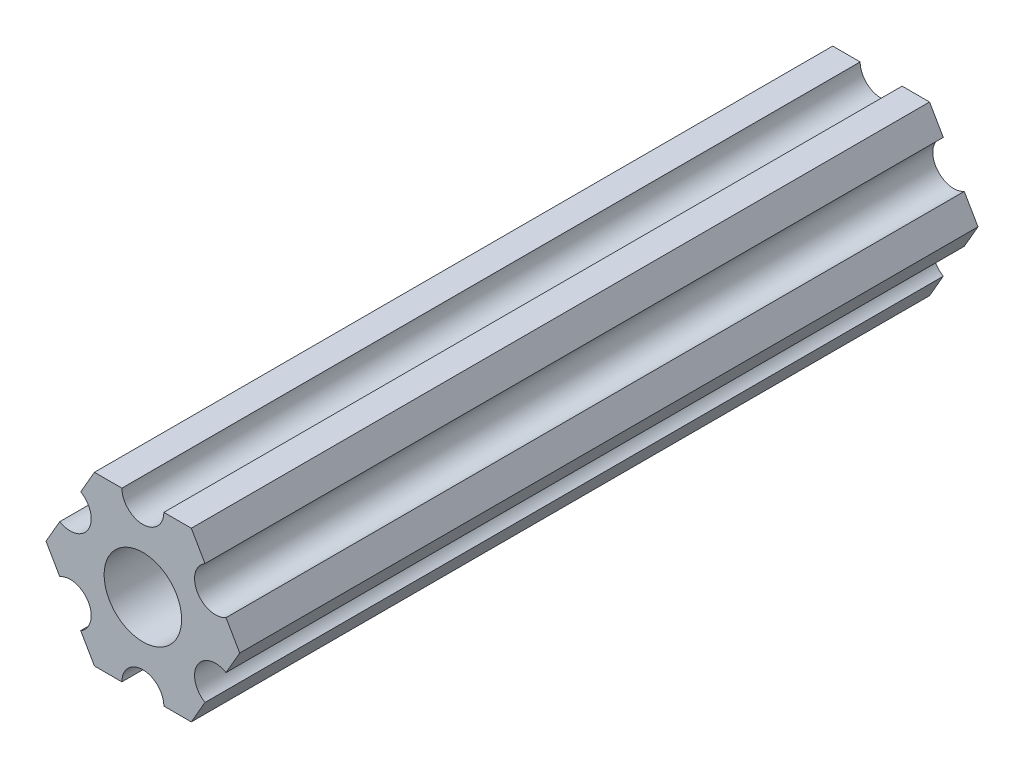
ISO-10303-21;
HEADER;
FILE_DESCRIPTION(('STEP AP214'),'2;1');
FILE_NAME('part.step','',(''),(''),'','','');
FILE_SCHEMA(('AUTOMOTIVE_DESIGN { 1 0 10303 214 1 1 1 1 }'));
ENDSEC;
DATA;
#1=APPLICATION_CONTEXT('core data for automotive mechanical design processes');
#2=APPLICATION_PROTOCOL_DEFINITION('international standard','automotive_design',2000,#1);
#3=PRODUCT_CONTEXT('',#1,'mechanical');
#4=PRODUCT('Part','Part','',(#3));
#5=PRODUCT_RELATED_PRODUCT_CATEGORY('part','',(#4));
#6=PRODUCT_DEFINITION_FORMATION('','',#4);
#7=PRODUCT_DEFINITION_CONTEXT('part definition',#1,'design');
#8=PRODUCT_DEFINITION('design','',#6,#7);
#9=PRODUCT_DEFINITION_SHAPE('','',#8);
#10=(LENGTH_UNIT() NAMED_UNIT(*) SI_UNIT(.MILLI.,.METRE.));
#11=(NAMED_UNIT(*) PLANE_ANGLE_UNIT() SI_UNIT($,.RADIAN.));
#12=(NAMED_UNIT(*) SI_UNIT($,.STERADIAN.) SOLID_ANGLE_UNIT());
#13=UNCERTAINTY_MEASURE_WITH_UNIT(LENGTH_MEASURE(1.E-05),#10,'distance_accuracy_value','');
#14=(GEOMETRIC_REPRESENTATION_CONTEXT(3) GLOBAL_UNCERTAINTY_ASSIGNED_CONTEXT((#13)) GLOBAL_UNIT_ASSIGNED_CONTEXT((#10,
#11,#12)) REPRESENTATION_CONTEXT('',''));
#15=CARTESIAN_POINT('',(0.,0.,0.));
#16=DIRECTION('',(0.,0.,1.));
#17=DIRECTION('',(1.,0.,0.));
#18=AXIS2_PLACEMENT_3D('',#15,#16,#17);
#19=CARTESIAN_POINT('',(-5.49926150638083,-3.17499966684068,-55.88));
#20=DIRECTION('',(0.,0.,1.));
#21=DIRECTION('',(1.,0.,0.));
#22=AXIS2_PLACEMENT_3D('',#19,#20,#21);
#23=CYLINDRICAL_SURFACE('',#22,1.58750000000001);
#24=CARTESIAN_POINT('',(-5.49926150638083,-3.17499966684068,0.));
#25=DIRECTION('',(0.,0.,-1.));
#26=DIRECTION('',(-1.,0.,0.));
#27=AXIS2_PLACEMENT_3D('',#24,#25,#26);
#28=CIRCLE('',#27,1.58750000000001);
#29=CARTESIAN_POINT('',(-6.29301142309098,-1.80018429024546,0.));
#30=VERTEX_POINT('',#29);
#31=CARTESIAN_POINT('',(-4.70551158967068,-4.54981504343589,0.));
#32=VERTEX_POINT('',#31);
#33=EDGE_CURVE('E196',#30,#32,#28,.T.);
#34=ORIENTED_EDGE('',*,*,#33,.F.);
#35=DIRECTION('',(0.,0.,1.));
#36=VECTOR('',#35,1.);
#37=CARTESIAN_POINT('',(-6.29301142309098,-1.80018429024546,-55.88));
#38=LINE('',#37,#36);
#39=CARTESIAN_POINT('',(-6.29301142309098,-1.80018429024546,-55.88));
#40=VERTEX_POINT('',#39);
#41=EDGE_CURVE('E11',#40,#30,#38,.T.);
#42=ORIENTED_EDGE('',*,*,#41,.F.);
#43=CARTESIAN_POINT('',(-5.49926150638083,-3.17499966684068,-55.88));
#44=DIRECTION('',(0.,0.,-1.));
#45=DIRECTION('',(-1.,0.,0.));
#46=AXIS2_PLACEMENT_3D('',#43,#44,#45);
#47=CIRCLE('',#46,1.58750000000001);
#48=CARTESIAN_POINT('',(-4.70551158967068,-4.54981504343589,-55.88));
#49=VERTEX_POINT('',#48);
#50=EDGE_CURVE('E247',#40,#49,#47,.T.);
#51=ORIENTED_EDGE('',*,*,#50,.T.);
#52=DIRECTION('',(0.,0.,1.));
#53=VECTOR('',#52,1.);
#54=CARTESIAN_POINT('',(-4.70551158967068,-4.54981504343589,-55.88));
#55=LINE('',#54,#53);
#56=EDGE_CURVE('E42',#49,#32,#55,.T.);
#57=ORIENTED_EDGE('',*,*,#56,.T.);
#58=EDGE_LOOP('',(#34,#42,#51,#57));
#59=FACE_BOUND('',#58,.T.);
#60=ADVANCED_FACE('F39',(#59),#23,.F.);
#61=CARTESIAN_POINT('',(-7.33234841870826,4.44212518856872E-07,-55.88));
#62=DIRECTION('',(-0.866025434075723,-0.499999947533953,0.));
#63=DIRECTION('',(0.499999947533953,-0.866025434075723,0.));
#64=AXIS2_PLACEMENT_3D('',#61,#62,#63);
#65=PLANE('',#64);
#66=DIRECTION('',(0.499999947533953,-0.866025434075723,0.));
#67=VECTOR('',#66,1.);
#68=CARTESIAN_POINT('',(-7.33234841870826,4.44212518856872E-07,0.));
#69=LINE('',#68,#67);
#70=CARTESIAN_POINT('',(-7.33234841870826,4.44212518856872E-07,0.));
#71=VERTEX_POINT('',#70);
#72=EDGE_CURVE('E245',#71,#30,#69,.T.);
#73=ORIENTED_EDGE('',*,*,#72,.F.);
#74=DIRECTION('',(0.,0.,1.));
#75=VECTOR('',#74,1.);
#76=CARTESIAN_POINT('',(-7.33234841870826,4.44212518856872E-07,-55.88));
#77=LINE('',#76,#75);
#78=CARTESIAN_POINT('',(-7.33234841870826,4.44212518856872E-07,-55.88));
#79=VERTEX_POINT('',#78);
#80=EDGE_CURVE('E48',#79,#71,#77,.T.);
#81=ORIENTED_EDGE('',*,*,#80,.F.);
#82=DIRECTION('',(0.499999947533953,-0.866025434075723,0.));
#83=VECTOR('',#82,1.);
#84=CARTESIAN_POINT('',(-7.33234841870826,4.44212518856872E-07,-55.88));
#85=LINE('',#84,#83);
#86=EDGE_CURVE('E186',#79,#40,#85,.T.);
#87=ORIENTED_EDGE('',*,*,#86,.T.);
#88=ORIENTED_EDGE('',*,*,#41,.T.);
#89=EDGE_LOOP('',(#73,#81,#87,#88));
#90=FACE_BOUND('',#89,.T.);
#91=ADVANCED_FACE('F279',(#90),#65,.T.);
#92=CARTESIAN_POINT('',(-6.29301120497139,1.80018505273895,-55.88));
#93=DIRECTION('',(-0.866025373493145,0.500000052466056,0.));
#94=DIRECTION('',(-0.500000052466056,-0.866025373493145,0.));
#95=AXIS2_PLACEMENT_3D('',#92,#93,#94);
#96=PLANE('',#95);
#97=DIRECTION('',(-0.500000052466056,-0.866025373493145,0.));
#98=VECTOR('',#97,1.);
#99=CARTESIAN_POINT('',(-6.29301120497139,1.80018505273895,0.));
#100=LINE('',#99,#98);
#101=CARTESIAN_POINT('',(-6.29301120497139,1.80018505273895,0.));
#102=VERTEX_POINT('',#101);
#103=EDGE_CURVE('E173',#102,#71,#100,.T.);
#104=ORIENTED_EDGE('',*,*,#103,.F.);
#105=DIRECTION('',(0.,0.,1.));
#106=VECTOR('',#105,1.);
#107=CARTESIAN_POINT('',(-6.29301120497139,1.80018505273895,-55.88));
#108=LINE('',#107,#106);
#109=CARTESIAN_POINT('',(-6.29301120497139,1.80018505273895,-55.88));
#110=VERTEX_POINT('',#109);
#111=EDGE_CURVE('E168',#110,#102,#108,.T.);
#112=ORIENTED_EDGE('',*,*,#111,.F.);
#113=DIRECTION('',(-0.500000052466056,-0.866025373493145,0.));
#114=VECTOR('',#113,1.);
#115=CARTESIAN_POINT('',(-6.29301120497139,1.80018505273895,-55.88));
#116=LINE('',#115,#114);
#117=EDGE_CURVE('E171',#110,#79,#116,.T.);
#118=ORIENTED_EDGE('',*,*,#117,.T.);
#119=ORIENTED_EDGE('',*,*,#80,.T.);
#120=EDGE_LOOP('',(#104,#112,#118,#119));
#121=FACE_BOUND('',#120,.T.);
#122=ADVANCED_FACE('F170',(#121),#96,.T.);
#123=CARTESIAN_POINT('',(-5.49926112168152,3.17500033315931,-55.88));
#124=DIRECTION('',(0.,0.,1.));
#125=DIRECTION('',(1.,0.,0.));
#126=AXIS2_PLACEMENT_3D('',#123,#124,#125);
#127=CYLINDRICAL_SURFACE('',#126,1.5875);
#128=CARTESIAN_POINT('',(-5.49926112168152,3.17500033315931,0.));
#129=DIRECTION('',(0.,0.,-1.));
#130=DIRECTION('',(-1.,0.,0.));
#131=AXIS2_PLACEMENT_3D('',#128,#129,#130);
#132=CIRCLE('',#131,1.5875);
#133=CARTESIAN_POINT('',(-4.70551103839166,4.54981561357968,0.));
#134=VERTEX_POINT('',#133);
#135=EDGE_CURVE('E242',#134,#102,#132,.T.);
#136=ORIENTED_EDGE('',*,*,#135,.F.);
#137=DIRECTION('',(0.,0.,1.));
#138=VECTOR('',#137,1.);
#139=CARTESIAN_POINT('',(-4.70551103839166,4.54981561357968,-55.88));
#140=LINE('',#139,#138);
#141=CARTESIAN_POINT('',(-4.70551103839166,4.54981561357968,-55.88));
#142=VERTEX_POINT('',#141);
#143=EDGE_CURVE('E178',#142,#134,#140,.T.);
#144=ORIENTED_EDGE('',*,*,#143,.F.);
#145=CARTESIAN_POINT('',(-5.49926112168152,3.17500033315931,-55.88));
#146=DIRECTION('',(0.,0.,-1.));
#147=DIRECTION('',(-1.,0.,0.));
#148=AXIS2_PLACEMENT_3D('',#145,#146,#147);
#149=CIRCLE('',#148,1.5875);
#150=EDGE_CURVE('E184',#142,#110,#149,.T.);
#151=ORIENTED_EDGE('',*,*,#150,.T.);
#152=ORIENTED_EDGE('',*,*,#111,.T.);
#153=EDGE_LOOP('',(#136,#144,#151,#152));
#154=FACE_BOUND('',#153,.T.);
#155=ADVANCED_FACE('F188',(#154),#127,.F.);
#156=CARTESIAN_POINT('',(-3.66617382465472,6.35000022210622,-55.88));
#157=DIRECTION('',(-0.866025373493145,0.500000052466056,0.));
#158=DIRECTION('',(-0.500000052466056,-0.866025373493145,0.));
#159=AXIS2_PLACEMENT_3D('',#156,#157,#158);
#160=PLANE('',#159);
#161=DIRECTION('',(-0.500000052466056,-0.866025373493145,0.));
#162=VECTOR('',#161,1.);
#163=CARTESIAN_POINT('',(-3.66617382465472,6.35000022210622,0.));
#164=LINE('',#163,#162);
#165=CARTESIAN_POINT('',(-3.66617382465472,6.35000022210622,0.));
#166=VERTEX_POINT('',#165);
#167=EDGE_CURVE('E239',#166,#134,#164,.T.);
#168=ORIENTED_EDGE('',*,*,#167,.F.);
#169=DIRECTION('',(0.,0.,1.));
#170=VECTOR('',#169,1.);
#171=CARTESIAN_POINT('',(-3.66617382465472,6.35000022210622,-55.88));
#172=LINE('',#171,#170);
#173=CARTESIAN_POINT('',(-3.66617382465472,6.35000022210622,-55.88));
#174=VERTEX_POINT('',#173);
#175=EDGE_CURVE('E251',#174,#166,#172,.T.);
#176=ORIENTED_EDGE('',*,*,#175,.F.);
#177=DIRECTION('',(-0.500000052466056,-0.866025373493145,0.));
#178=VECTOR('',#177,1.);
#179=CARTESIAN_POINT('',(-3.66617382465472,6.35000022210622,-55.88));
#180=LINE('',#179,#178);
#181=EDGE_CURVE('E189',#174,#142,#180,.T.);
#182=ORIENTED_EDGE('',*,*,#181,.T.);
#183=ORIENTED_EDGE('',*,*,#143,.T.);
#184=EDGE_LOOP('',(#168,#176,#182,#183));
#185=FACE_BOUND('',#184,.T.);
#186=ADVANCED_FACE('F292',(#185),#160,.T.);
#187=CARTESIAN_POINT('',(-1.58749884590197,6.35000022210623,-55.88));
#188=DIRECTION('',(0.,1.,0.));
#189=DIRECTION('',(-1.,0.,0.));
#190=AXIS2_PLACEMENT_3D('',#187,#188,#189);
#191=PLANE('',#190);
#192=DIRECTION('',(-1.,0.,0.));
#193=VECTOR('',#192,1.);
#194=CARTESIAN_POINT('',(-1.58749884590197,6.35000022210623,0.));
#195=LINE('',#194,#193);
#196=CARTESIAN_POINT('',(-1.58749884590197,6.35000022210623,0.));
#197=VERTEX_POINT('',#196);
#198=EDGE_CURVE('E236',#197,#166,#195,.T.);
#199=ORIENTED_EDGE('',*,*,#198,.F.);
#200=DIRECTION('',(0.,0.,1.));
#201=VECTOR('',#200,1.);
#202=CARTESIAN_POINT('',(-1.58749884590197,6.35000022210623,-55.88));
#203=LINE('',#202,#201);
#204=CARTESIAN_POINT('',(-1.58749884590197,6.35000022210623,-55.88));
#205=VERTEX_POINT('',#204);
#206=EDGE_CURVE('E253',#205,#197,#203,.T.);
#207=ORIENTED_EDGE('',*,*,#206,.F.);
#208=DIRECTION('',(-1.,0.,0.));
#209=VECTOR('',#208,1.);
#210=CARTESIAN_POINT('',(-1.58749884590197,6.35000022210623,-55.88));
#211=LINE('',#210,#209);
#212=EDGE_CURVE('E191',#205,#174,#211,.T.);
#213=ORIENTED_EDGE('',*,*,#212,.T.);
#214=ORIENTED_EDGE('',*,*,#175,.T.);
#215=EDGE_LOOP('',(#199,#207,#213,#214));
#216=FACE_BOUND('',#215,.T.);
#217=ADVANCED_FACE('F295',(#216),#191,.T.);
#218=CARTESIAN_POINT('',(3.84699344941095E-07,6.35000022210623,-55.88));
#219=DIRECTION('',(0.,0.,1.));
#220=DIRECTION('',(1.,0.,0.));
#221=AXIS2_PLACEMENT_3D('',#218,#219,#220);
#222=CYLINDRICAL_SURFACE('',#221,1.58749884590197);
#223=CARTESIAN_POINT('',(3.84699344941095E-07,6.35000022210623,0.));
#224=DIRECTION('',(0.,0.,-1.));
#225=DIRECTION('',(-1.,0.,0.));
#226=AXIS2_PLACEMENT_3D('',#223,#224,#225);
#227=CIRCLE('',#226,1.58749884590197);
#228=CARTESIAN_POINT('',(1.58749923060131,6.35000022210623,0.));
#229=VERTEX_POINT('',#228);
#230=EDGE_CURVE('E233',#229,#197,#227,.T.);
#231=ORIENTED_EDGE('',*,*,#230,.F.);
#232=DIRECTION('',(0.,0.,1.));
#233=VECTOR('',#232,1.);
#234=CARTESIAN_POINT('',(1.58749923060131,6.35000022210623,-55.88));
#235=LINE('',#234,#233);
#236=CARTESIAN_POINT('',(1.58749923060131,6.35000022210623,-55.88));
#237=VERTEX_POINT('',#236);
#238=EDGE_CURVE('E255',#237,#229,#235,.T.);
#239=ORIENTED_EDGE('',*,*,#238,.F.);
#240=CARTESIAN_POINT('',(3.84699344941095E-07,6.35000022210623,-55.88));
#241=DIRECTION('',(0.,0.,-1.));
#242=DIRECTION('',(-1.,0.,0.));
#243=AXIS2_PLACEMENT_3D('',#240,#241,#242);
#244=CIRCLE('',#243,1.58749884590197);
#245=EDGE_CURVE('E400',#237,#205,#244,.T.);
#246=ORIENTED_EDGE('',*,*,#245,.T.);
#247=ORIENTED_EDGE('',*,*,#206,.T.);
#248=EDGE_LOOP('',(#231,#239,#246,#247));
#249=FACE_BOUND('',#248,.T.);
#250=ADVANCED_FACE('F299',(#249),#222,.F.);
#251=CARTESIAN_POINT('',(3.66617452134701,6.35000022210623,-55.88));
#252=DIRECTION('',(0.,1.,0.));
#253=DIRECTION('',(-1.,0.,0.));
#254=AXIS2_PLACEMENT_3D('',#251,#252,#253);
#255=PLANE('',#254);
#256=DIRECTION('',(-1.,0.,0.));
#257=VECTOR('',#256,1.);
#258=CARTESIAN_POINT('',(3.66617452134701,6.35000022210623,0.));
#259=LINE('',#258,#257);
#260=CARTESIAN_POINT('',(3.66617452134701,6.35000022210623,0.));
#261=VERTEX_POINT('',#260);
#262=EDGE_CURVE('E230',#261,#229,#259,.T.);
#263=ORIENTED_EDGE('',*,*,#262,.F.);
#264=DIRECTION('',(0.,0.,1.));
#265=VECTOR('',#264,1.);
#266=CARTESIAN_POINT('',(3.66617452134701,6.35000022210623,-55.88));
#267=LINE('',#266,#265);
#268=CARTESIAN_POINT('',(3.66617452134701,6.35000022210623,-55.88));
#269=VERTEX_POINT('',#268);
#270=EDGE_CURVE('E257',#269,#261,#267,.T.);
#271=ORIENTED_EDGE('',*,*,#270,.F.);
#272=DIRECTION('',(-1.,0.,0.));
#273=VECTOR('',#272,1.);
#274=CARTESIAN_POINT('',(3.66617452134701,6.35000022210623,-55.88));
#275=LINE('',#274,#273);
#276=EDGE_CURVE('E397',#269,#237,#275,.T.);
#277=ORIENTED_EDGE('',*,*,#276,.T.);
#278=ORIENTED_EDGE('',*,*,#238,.T.);
#279=EDGE_LOOP('',(#263,#271,#277,#278));
#280=FACE_BOUND('',#279,.T.);
#281=ADVANCED_FACE('F303',(#280),#255,.T.);
#282=CARTESIAN_POINT('',(4.70551142760333,4.54981551649452,-55.88));
#283=DIRECTION('',(0.866025449221368,0.499999921300922,0.));
#284=DIRECTION('',(-0.499999921300922,0.866025449221368,0.));
#285=AXIS2_PLACEMENT_3D('',#282,#283,#284);
#286=PLANE('',#285);
#287=DIRECTION('',(-0.499999921300922,0.866025449221368,0.));
#288=VECTOR('',#287,1.);
#289=CARTESIAN_POINT('',(4.70551142760333,4.54981551649452,0.));
#290=LINE('',#289,#288);
#291=CARTESIAN_POINT('',(4.70551142760333,4.54981551649452,0.));
#292=VERTEX_POINT('',#291);
#293=EDGE_CURVE('E227',#292,#261,#290,.T.);
#294=ORIENTED_EDGE('',*,*,#293,.F.);
#295=DIRECTION('',(0.,0.,1.));
#296=VECTOR('',#295,1.);
#297=CARTESIAN_POINT('',(4.70551142760333,4.54981551649452,-55.88));
#298=LINE('',#297,#296);
#299=CARTESIAN_POINT('',(4.70551142760333,4.54981551649452,-55.88));
#300=VERTEX_POINT('',#299);
#301=EDGE_CURVE('E259',#300,#292,#298,.T.);
#302=ORIENTED_EDGE('',*,*,#301,.F.);
#303=DIRECTION('',(-0.499999921300922,0.866025449221368,0.));
#304=VECTOR('',#303,1.);
#305=CARTESIAN_POINT('',(4.70551142760333,4.54981551649452,-55.88));
#306=LINE('',#305,#304);
#307=EDGE_CURVE('E394',#300,#269,#306,.T.);
#308=ORIENTED_EDGE('',*,*,#307,.T.);
#309=ORIENTED_EDGE('',*,*,#270,.T.);
#310=EDGE_LOOP('',(#294,#302,#308,#309));
#311=FACE_BOUND('',#310,.T.);
#312=ADVANCED_FACE('F307',(#311),#286,.T.);
#313=CARTESIAN_POINT('',(5.49926130266854,3.1750001158556,-55.88));
#314=DIRECTION('',(0.,0.,1.));
#315=DIRECTION('',(1.,0.,0.));
#316=AXIS2_PLACEMENT_3D('',#313,#314,#315);
#317=CYLINDRICAL_SURFACE('',#316,1.5875);
#318=CARTESIAN_POINT('',(5.49926130266854,3.1750001158556,0.));
#319=DIRECTION('',(0.,0.,-1.));
#320=DIRECTION('',(-1.,0.,0.));
#321=AXIS2_PLACEMENT_3D('',#318,#319,#320);
#322=CIRCLE('',#321,1.5875);
#323=CARTESIAN_POINT('',(6.29301117773375,1.80018471521667,0.));
#324=VERTEX_POINT('',#323);
#325=EDGE_CURVE('E224',#324,#292,#322,.T.);
#326=ORIENTED_EDGE('',*,*,#325,.F.);
#327=DIRECTION('',(0.,0.,1.));
#328=VECTOR('',#327,1.);
#329=CARTESIAN_POINT('',(6.29301117773375,1.80018471521667,-55.88));
#330=LINE('',#329,#328);
#331=CARTESIAN_POINT('',(6.29301117773375,1.80018471521667,-55.88));
#332=VERTEX_POINT('',#331);
#333=EDGE_CURVE('E261',#332,#324,#330,.T.);
#334=ORIENTED_EDGE('',*,*,#333,.F.);
#335=CARTESIAN_POINT('',(5.49926130266854,3.1750001158556,-55.88));
#336=DIRECTION('',(0.,0.,-1.));
#337=DIRECTION('',(-1.,0.,0.));
#338=AXIS2_PLACEMENT_3D('',#335,#336,#337);
#339=CIRCLE('',#338,1.5875);
#340=EDGE_CURVE('E391',#332,#300,#339,.T.);
#341=ORIENTED_EDGE('',*,*,#340,.T.);
#342=ORIENTED_EDGE('',*,*,#301,.T.);
#343=EDGE_LOOP('',(#326,#334,#341,#342));
#344=FACE_BOUND('',#343,.T.);
#345=ADVANCED_FACE('F311',(#344),#317,.F.);
#346=CARTESIAN_POINT('',(7.33234803400895,9.61748368946088E-08,-55.88));
#347=DIRECTION('',(0.866025449221368,0.499999921300922,0.));
#348=DIRECTION('',(-0.499999921300922,0.866025449221368,0.));
#349=AXIS2_PLACEMENT_3D('',#346,#347,#348);
#350=PLANE('',#349);
#351=DIRECTION('',(-0.499999921300922,0.866025449221368,0.));
#352=VECTOR('',#351,1.);
#353=CARTESIAN_POINT('',(7.33234803400895,9.61748368946088E-08,0.));
#354=LINE('',#353,#352);
#355=CARTESIAN_POINT('',(7.33234803400895,9.61748368946088E-08,0.));
#356=VERTEX_POINT('',#355);
#357=EDGE_CURVE('E221',#356,#324,#354,.T.);
#358=ORIENTED_EDGE('',*,*,#357,.F.);
#359=DIRECTION('',(0.,0.,1.));
#360=VECTOR('',#359,1.);
#361=CARTESIAN_POINT('',(7.33234803400895,9.61748368946088E-08,-55.88));
#362=LINE('',#361,#360);
#363=CARTESIAN_POINT('',(7.33234803400895,9.61748368946088E-08,-55.88));
#364=VERTEX_POINT('',#363);
#365=EDGE_CURVE('E263',#364,#356,#362,.T.);
#366=ORIENTED_EDGE('',*,*,#365,.F.);
#367=DIRECTION('',(-0.499999921300922,0.866025449221368,0.));
#368=VECTOR('',#367,1.);
#369=CARTESIAN_POINT('',(7.33234803400895,9.61748368946088E-08,-55.88));
#370=LINE('',#369,#368);
#371=EDGE_CURVE('E388',#364,#332,#370,.T.);
#372=ORIENTED_EDGE('',*,*,#371,.T.);
#373=ORIENTED_EDGE('',*,*,#333,.T.);
#374=EDGE_LOOP('',(#358,#366,#372,#373));
#375=FACE_BOUND('',#374,.T.);
#376=ADVANCED_FACE('F315',(#375),#350,.T.);
#377=CARTESIAN_POINT('',(6.29301092933191,-1.80018457531732,-55.88));
#378=DIRECTION('',(0.866025403784438,-0.5,0.));
#379=DIRECTION('',(0.5,0.866025403784438,0.));
#380=AXIS2_PLACEMENT_3D('',#377,#378,#379);
#381=PLANE('',#380);
#382=DIRECTION('',(0.5,0.866025403784438,0.));
#383=VECTOR('',#382,1.);
#384=CARTESIAN_POINT('',(6.29301092933191,-1.80018457531732,0.));
#385=LINE('',#384,#383);
#386=CARTESIAN_POINT('',(6.29301092933191,-1.80018457531732,0.));
#387=VERTEX_POINT('',#386);
#388=EDGE_CURVE('E218',#387,#356,#385,.T.);
#389=ORIENTED_EDGE('',*,*,#388,.F.);
#390=DIRECTION('',(0.,0.,1.));
#391=VECTOR('',#390,1.);
#392=CARTESIAN_POINT('',(6.29301092933191,-1.80018457531732,-55.88));
#393=LINE('',#392,#391);
#394=CARTESIAN_POINT('',(6.29301092933191,-1.80018457531732,-55.88));
#395=VERTEX_POINT('',#394);
#396=EDGE_CURVE('E265',#395,#387,#393,.T.);
#397=ORIENTED_EDGE('',*,*,#396,.F.);
#398=DIRECTION('',(0.5,0.866025403784438,0.));
#399=VECTOR('',#398,1.);
#400=CARTESIAN_POINT('',(6.29301092933191,-1.80018457531732,-55.88));
#401=LINE('',#400,#399);
#402=EDGE_CURVE('E385',#395,#364,#401,.T.);
#403=ORIENTED_EDGE('',*,*,#402,.T.);
#404=ORIENTED_EDGE('',*,*,#365,.T.);
#405=EDGE_LOOP('',(#389,#397,#403,#404));
#406=FACE_BOUND('',#405,.T.);
#407=ADVANCED_FACE('F319',(#406),#381,.T.);
#408=CARTESIAN_POINT('',(5.49926092933191,-3.17499990382512,-55.88));
#409=DIRECTION('',(0.,0.,1.));
#410=DIRECTION('',(1.,0.,0.));
#411=AXIS2_PLACEMENT_3D('',#408,#409,#410);
#412=CYLINDRICAL_SURFACE('',#411,1.5875);
#413=CARTESIAN_POINT('',(5.49926092933191,-3.17499990382512,0.));
#414=DIRECTION('',(0.,0.,-1.));
#415=DIRECTION('',(-1.,0.,0.));
#416=AXIS2_PLACEMENT_3D('',#413,#414,#415);
#417=CIRCLE('',#416,1.5875);
#418=CARTESIAN_POINT('',(4.70551092933191,-4.54981523233291,0.));
#419=VERTEX_POINT('',#418);
#420=EDGE_CURVE('E215',#419,#387,#417,.T.);
#421=ORIENTED_EDGE('',*,*,#420,.F.);
#422=DIRECTION('',(0.,0.,1.));
#423=VECTOR('',#422,1.);
#424=CARTESIAN_POINT('',(4.70551092933191,-4.54981523233291,-55.88));
#425=LINE('',#424,#423);
#426=CARTESIAN_POINT('',(4.70551092933191,-4.54981523233291,-55.88));
#427=VERTEX_POINT('',#426);
#428=EDGE_CURVE('E267',#427,#419,#425,.T.);
#429=ORIENTED_EDGE('',*,*,#428,.F.);
#430=CARTESIAN_POINT('',(5.49926092933191,-3.17499990382512,-55.88));
#431=DIRECTION('',(0.,0.,-1.));
#432=DIRECTION('',(-1.,0.,0.));
#433=AXIS2_PLACEMENT_3D('',#430,#431,#432);
#434=CIRCLE('',#433,1.5875);
#435=EDGE_CURVE('E382',#427,#395,#434,.T.);
#436=ORIENTED_EDGE('',*,*,#435,.T.);
#437=ORIENTED_EDGE('',*,*,#396,.T.);
#438=EDGE_LOOP('',(#421,#429,#436,#437));
#439=FACE_BOUND('',#438,.T.);
#440=ADVANCED_FACE('F323',(#439),#412,.F.);
#441=CARTESIAN_POINT('',(3.66617382465481,-6.34999990382519,-55.88));
#442=DIRECTION('',(0.866025403784438,-0.5,0.));
#443=DIRECTION('',(0.5,0.866025403784439,0.));
#444=AXIS2_PLACEMENT_3D('',#441,#442,#443);
#445=PLANE('',#444);
#446=DIRECTION('',(0.5,0.866025403784439,0.));
#447=VECTOR('',#446,1.);
#448=CARTESIAN_POINT('',(3.66617382465481,-6.34999990382519,0.));
#449=LINE('',#448,#447);
#450=CARTESIAN_POINT('',(3.66617382465481,-6.34999990382519,0.));
#451=VERTEX_POINT('',#450);
#452=EDGE_CURVE('E212',#451,#419,#449,.T.);
#453=ORIENTED_EDGE('',*,*,#452,.F.);
#454=DIRECTION('',(0.,0.,1.));
#455=VECTOR('',#454,1.);
#456=CARTESIAN_POINT('',(3.66617382465481,-6.34999990382519,-55.88));
#457=LINE('',#456,#455);
#458=CARTESIAN_POINT('',(3.66617382465481,-6.34999990382519,-55.88));
#459=VERTEX_POINT('',#458);
#460=EDGE_CURVE('E269',#459,#451,#457,.T.);
#461=ORIENTED_EDGE('',*,*,#460,.F.);
#462=DIRECTION('',(0.5,0.866025403784439,0.));
#463=VECTOR('',#462,1.);
#464=CARTESIAN_POINT('',(3.66617382465481,-6.34999990382519,-55.88));
#465=LINE('',#464,#463);
#466=EDGE_CURVE('E379',#459,#427,#465,.T.);
#467=ORIENTED_EDGE('',*,*,#466,.T.);
#468=ORIENTED_EDGE('',*,*,#428,.T.);
#469=EDGE_LOOP('',(#453,#461,#467,#468));
#470=FACE_BOUND('',#469,.T.);
#471=ADVANCED_FACE('F327',(#470),#445,.T.);
#472=CARTESIAN_POINT('',(1.58750115409778,-6.34999990382519,-55.88));
#473=DIRECTION('',(0.,-1.,0.));
#474=DIRECTION('',(1.,0.,0.));
#475=AXIS2_PLACEMENT_3D('',#472,#473,#474);
#476=PLANE('',#475);
#477=DIRECTION('',(1.,0.,0.));
#478=VECTOR('',#477,1.);
#479=CARTESIAN_POINT('',(1.58750115409778,-6.34999990382519,0.));
#480=LINE('',#479,#478);
#481=CARTESIAN_POINT('',(1.58750115409778,-6.34999990382519,0.));
#482=VERTEX_POINT('',#481);
#483=EDGE_CURVE('E209',#482,#451,#480,.T.);
#484=ORIENTED_EDGE('',*,*,#483,.F.);
#485=DIRECTION('',(0.,0.,1.));
#486=VECTOR('',#485,1.);
#487=CARTESIAN_POINT('',(1.58750115409778,-6.34999990382519,-55.88));
#488=LINE('',#487,#486);
#489=CARTESIAN_POINT('',(1.58750115409778,-6.34999990382519,-55.88));
#490=VERTEX_POINT('',#489);
#491=EDGE_CURVE('E271',#490,#482,#488,.T.);
#492=ORIENTED_EDGE('',*,*,#491,.F.);
#493=DIRECTION('',(1.,0.,0.));
#494=VECTOR('',#493,1.);
#495=CARTESIAN_POINT('',(1.58750115409778,-6.34999990382519,-55.88));
#496=LINE('',#495,#494);
#497=EDGE_CURVE('E376',#490,#459,#496,.T.);
#498=ORIENTED_EDGE('',*,*,#497,.T.);
#499=ORIENTED_EDGE('',*,*,#460,.T.);
#500=EDGE_LOOP('',(#484,#492,#498,#499));
#501=FACE_BOUND('',#500,.T.);
#502=ADVANCED_FACE('F331',(#501),#476,.T.);
#503=CARTESIAN_POINT('',(-3.8469926204343E-07,-6.34999990382519,-55.88));
#504=DIRECTION('',(0.,0.,1.));
#505=DIRECTION('',(1.,0.,0.));
#506=AXIS2_PLACEMENT_3D('',#503,#504,#505);
#507=CYLINDRICAL_SURFACE('',#506,1.58750115409778);
#508=CARTESIAN_POINT('',(-3.8469926204343E-07,-6.34999990382519,0.));
#509=DIRECTION('',(0.,0.,-1.));
#510=DIRECTION('',(-1.,0.,0.));
#511=AXIS2_PLACEMENT_3D('',#508,#509,#510);
#512=CIRCLE('',#511,1.58750115409778);
#513=CARTESIAN_POINT('',(-1.58750153879705,-6.34999990382519,0.));
#514=VERTEX_POINT('',#513);
#515=EDGE_CURVE('E206',#514,#482,#512,.T.);
#516=ORIENTED_EDGE('',*,*,#515,.F.);
#517=DIRECTION('',(0.,0.,1.));
#518=VECTOR('',#517,1.);
#519=CARTESIAN_POINT('',(-1.58750153879705,-6.34999990382519,-55.88));
#520=LINE('',#519,#518);
#521=CARTESIAN_POINT('',(-1.58750153879705,-6.34999990382519,-55.88));
#522=VERTEX_POINT('',#521);
#523=EDGE_CURVE('E273',#522,#514,#520,.T.);
#524=ORIENTED_EDGE('',*,*,#523,.F.);
#525=CARTESIAN_POINT('',(-3.8469926204343E-07,-6.34999990382519,-55.88));
#526=DIRECTION('',(0.,0.,-1.));
#527=DIRECTION('',(-1.,0.,0.));
#528=AXIS2_PLACEMENT_3D('',#525,#526,#527);
#529=CIRCLE('',#528,1.58750115409778);
#530=EDGE_CURVE('E373',#522,#490,#529,.T.);
#531=ORIENTED_EDGE('',*,*,#530,.T.);
#532=ORIENTED_EDGE('',*,*,#491,.T.);
#533=EDGE_LOOP('',(#516,#524,#531,#532));
#534=FACE_BOUND('',#533,.T.);
#535=ADVANCED_FACE('F335',(#534),#507,.F.);
#536=CARTESIAN_POINT('',(-3.66617452134693,-6.34999990382519,-55.88));
#537=DIRECTION('',(0.,-1.,0.));
#538=DIRECTION('',(1.,0.,0.));
#539=AXIS2_PLACEMENT_3D('',#536,#537,#538);
#540=PLANE('',#539);
#541=DIRECTION('',(1.,0.,0.));
#542=VECTOR('',#541,1.);
#543=CARTESIAN_POINT('',(-3.66617452134693,-6.34999990382519,0.));
#544=LINE('',#543,#542);
#545=CARTESIAN_POINT('',(-3.66617452134693,-6.34999990382519,0.));
#546=VERTEX_POINT('',#545);
#547=EDGE_CURVE('E203',#546,#514,#544,.T.);
#548=ORIENTED_EDGE('',*,*,#547,.F.);
#549=DIRECTION('',(0.,0.,1.));
#550=VECTOR('',#549,1.);
#551=CARTESIAN_POINT('',(-3.66617452134693,-6.34999990382519,-55.88));
#552=LINE('',#551,#550);
#553=CARTESIAN_POINT('',(-3.66617452134693,-6.34999990382519,-55.88));
#554=VERTEX_POINT('',#553);
#555=EDGE_CURVE('E274',#554,#546,#552,.T.);
#556=ORIENTED_EDGE('',*,*,#555,.F.);
#557=DIRECTION('',(1.,0.,0.));
#558=VECTOR('',#557,1.);
#559=CARTESIAN_POINT('',(-3.66617452134693,-6.34999990382519,-55.88));
#560=LINE('',#559,#558);
#561=EDGE_CURVE('E370',#554,#522,#560,.T.);
#562=ORIENTED_EDGE('',*,*,#561,.T.);
#563=ORIENTED_EDGE('',*,*,#523,.T.);
#564=EDGE_LOOP('',(#548,#556,#562,#563));
#565=FACE_BOUND('',#564,.T.);
#566=ADVANCED_FACE('F339',(#565),#540,.T.);
#567=CARTESIAN_POINT('',(-4.70551158967068,-4.54981504343589,-55.88));
#568=DIRECTION('',(-0.866025434075723,-0.499999947533953,0.));
#569=DIRECTION('',(0.499999947533953,-0.866025434075723,0.));
#570=AXIS2_PLACEMENT_3D('',#567,#568,#569);
#571=PLANE('',#570);
#572=DIRECTION('',(0.499999947533953,-0.866025434075723,0.));
#573=VECTOR('',#572,1.);
#574=CARTESIAN_POINT('',(-4.70551158967068,-4.54981504343589,0.));
#575=LINE('',#574,#573);
#576=EDGE_CURVE('E199',#32,#546,#575,.T.);
#577=ORIENTED_EDGE('',*,*,#576,.F.);
#578=ORIENTED_EDGE('',*,*,#56,.F.);
#579=DIRECTION('',(0.499999947533953,-0.866025434075723,0.));
#580=VECTOR('',#579,1.);
#581=CARTESIAN_POINT('',(-4.70551158967068,-4.54981504343589,-55.88));
#582=LINE('',#581,#580);
#583=EDGE_CURVE('E368',#49,#554,#582,.T.);
#584=ORIENTED_EDGE('',*,*,#583,.T.);
#585=ORIENTED_EDGE('',*,*,#555,.T.);
#586=EDGE_LOOP('',(#577,#578,#584,#585));
#587=FACE_BOUND('',#586,.T.);
#588=ADVANCED_FACE('F276',(#587),#571,.T.);
#589=CARTESIAN_POINT('',(-5.49926150638083,-3.17499966684068,-55.88));
#590=DIRECTION('',(0.,0.,-1.));
#591=DIRECTION('',(-1.,0.,0.));
#592=AXIS2_PLACEMENT_3D('',#589,#590,#591);
#593=PLANE('',#592);
#594=CARTESIAN_POINT('',(0.,0.,-55.88));
#595=DIRECTION('',(0.,0.,1.));
#596=DIRECTION('',(-1.,0.,0.));
#597=AXIS2_PLACEMENT_3D('',#594,#595,#596);
#598=CIRCLE('',#597,2.9337);
#599=CARTESIAN_POINT('',(-2.9337,0.,-55.88));
#600=VERTEX_POINT('',#599);
#601=EDGE_CURVE('E200',#600,#600,#598,.T.);
#602=ORIENTED_EDGE('',*,*,#601,.T.);
#603=EDGE_LOOP('',(#602));
#604=FACE_BOUND('',#603,.T.);
#605=ORIENTED_EDGE('',*,*,#50,.F.);
#606=ORIENTED_EDGE('',*,*,#86,.F.);
#607=ORIENTED_EDGE('',*,*,#117,.F.);
#608=ORIENTED_EDGE('',*,*,#150,.F.);
#609=ORIENTED_EDGE('',*,*,#181,.F.);
#610=ORIENTED_EDGE('',*,*,#212,.F.);
#611=ORIENTED_EDGE('',*,*,#245,.F.);
#612=ORIENTED_EDGE('',*,*,#276,.F.);
#613=ORIENTED_EDGE('',*,*,#307,.F.);
#614=ORIENTED_EDGE('',*,*,#340,.F.);
#615=ORIENTED_EDGE('',*,*,#371,.F.);
#616=ORIENTED_EDGE('',*,*,#402,.F.);
#617=ORIENTED_EDGE('',*,*,#435,.F.);
#618=ORIENTED_EDGE('',*,*,#466,.F.);
#619=ORIENTED_EDGE('',*,*,#497,.F.);
#620=ORIENTED_EDGE('',*,*,#530,.F.);
#621=ORIENTED_EDGE('',*,*,#561,.F.);
#622=ORIENTED_EDGE('',*,*,#583,.F.);
#623=EDGE_LOOP('',(#605,#606,#607,#608,#609,#610,#611,#612,#613,#614,#615,#616,#617,#618,#619,
#620,#621,#622));
#624=FACE_BOUND('',#623,.T.);
#625=ADVANCED_FACE('F182',(#604,#624),#593,.T.);
#626=CARTESIAN_POINT('',(-5.49926150638083,-3.17499966684068,0.));
#627=DIRECTION('',(0.,0.,-1.));
#628=DIRECTION('',(-1.,0.,0.));
#629=AXIS2_PLACEMENT_3D('',#626,#627,#628);
#630=PLANE('',#629);
#631=CARTESIAN_POINT('',(0.,0.,0.));
#632=DIRECTION('',(0.,0.,1.));
#633=DIRECTION('',(-1.,0.,0.));
#634=AXIS2_PLACEMENT_3D('',#631,#632,#633);
#635=CIRCLE('',#634,2.9337);
#636=CARTESIAN_POINT('',(-2.9337,0.,0.));
#637=VERTEX_POINT('',#636);
#638=EDGE_CURVE('E363',#637,#637,#635,.T.);
#639=ORIENTED_EDGE('',*,*,#638,.F.);
#640=EDGE_LOOP('',(#639));
#641=FACE_BOUND('',#640,.T.);
#642=ORIENTED_EDGE('',*,*,#33,.T.);
#643=ORIENTED_EDGE('',*,*,#576,.T.);
#644=ORIENTED_EDGE('',*,*,#547,.T.);
#645=ORIENTED_EDGE('',*,*,#515,.T.);
#646=ORIENTED_EDGE('',*,*,#483,.T.);
#647=ORIENTED_EDGE('',*,*,#452,.T.);
#648=ORIENTED_EDGE('',*,*,#420,.T.);
#649=ORIENTED_EDGE('',*,*,#388,.T.);
#650=ORIENTED_EDGE('',*,*,#357,.T.);
#651=ORIENTED_EDGE('',*,*,#325,.T.);
#652=ORIENTED_EDGE('',*,*,#293,.T.);
#653=ORIENTED_EDGE('',*,*,#262,.T.);
#654=ORIENTED_EDGE('',*,*,#230,.T.);
#655=ORIENTED_EDGE('',*,*,#198,.T.);
#656=ORIENTED_EDGE('',*,*,#167,.T.);
#657=ORIENTED_EDGE('',*,*,#135,.T.);
#658=ORIENTED_EDGE('',*,*,#103,.T.);
#659=ORIENTED_EDGE('',*,*,#72,.T.);
#660=EDGE_LOOP('',(#642,#643,#644,#645,#646,#647,#648,#649,#650,#651,#652,#653,#654,#655,#656,
#657,#658,#659));
#661=FACE_BOUND('',#660,.T.);
#662=ADVANCED_FACE('F278',(#641,#661),#630,.F.);
#663=CARTESIAN_POINT('',(0.,0.,-55.88));
#664=DIRECTION('',(0.,0.,1.));
#665=DIRECTION('',(1.,0.,0.));
#666=AXIS2_PLACEMENT_3D('',#663,#664,#665);
#667=CYLINDRICAL_SURFACE('',#666,2.9337);
#668=ORIENTED_EDGE('',*,*,#601,.F.);
#669=EDGE_LOOP('',(#668));
#670=FACE_BOUND('',#669,.T.);
#671=ORIENTED_EDGE('',*,*,#638,.T.);
#672=EDGE_LOOP('',(#671));
#673=FACE_BOUND('',#672,.T.);
#674=ADVANCED_FACE('F351',(#670,#673),#667,.F.);
#675=CLOSED_SHELL('',(#60,#91,#122,#155,#186,#217,#250,#281,#312,#345,#376,#407,#440,#471,#502,
#535,#566,#588,#625,#662,#674));
#676=MANIFOLD_SOLID_BREP('B2',#675);
#677=ADVANCED_BREP_SHAPE_REPRESENTATION('',(#18,#676),#14);
#678=SHAPE_DEFINITION_REPRESENTATION(#9,#677);
ENDSEC;
END-ISO-10303-21;
